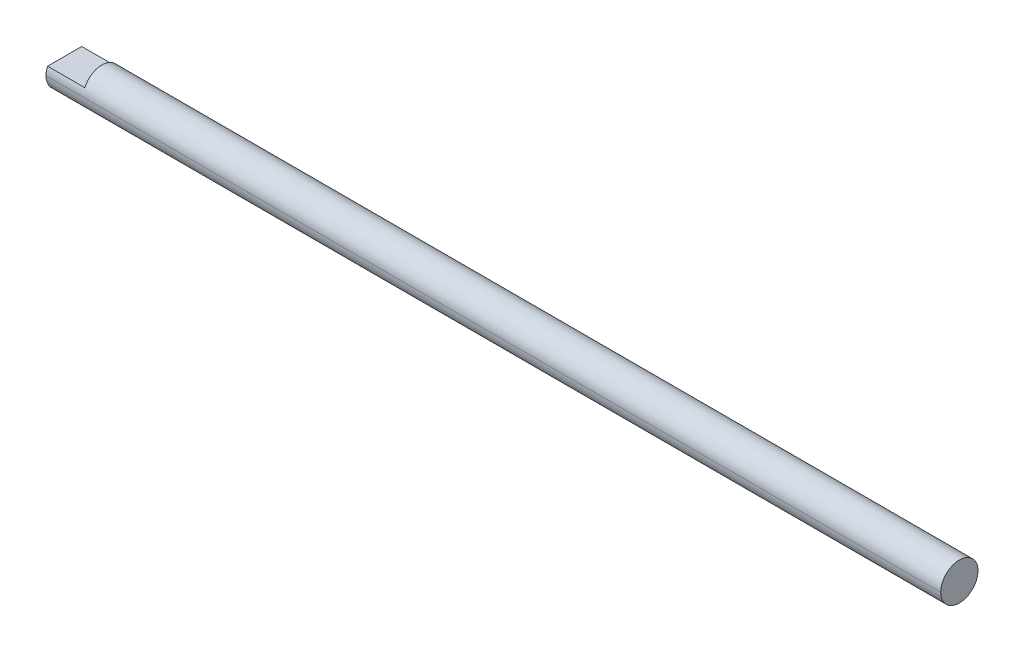
ISO-10303-21;
HEADER;
FILE_DESCRIPTION(('STEP AP214'),'2;1');
FILE_NAME('part.step','',(''),(''),'','','');
FILE_SCHEMA(('AUTOMOTIVE_DESIGN { 1 0 10303 214 1 1 1 1 }'));
ENDSEC;
DATA;
#1=APPLICATION_CONTEXT('core data for automotive mechanical design processes');
#2=APPLICATION_PROTOCOL_DEFINITION('international standard','automotive_design',2000,#1);
#3=PRODUCT_CONTEXT('',#1,'mechanical');
#4=PRODUCT('Part','Part','',(#3));
#5=PRODUCT_RELATED_PRODUCT_CATEGORY('part','',(#4));
#6=PRODUCT_DEFINITION_FORMATION('','',#4);
#7=PRODUCT_DEFINITION_CONTEXT('part definition',#1,'design');
#8=PRODUCT_DEFINITION('design','',#6,#7);
#9=PRODUCT_DEFINITION_SHAPE('','',#8);
#10=(LENGTH_UNIT() NAMED_UNIT(*) SI_UNIT(.MILLI.,.METRE.));
#11=(NAMED_UNIT(*) PLANE_ANGLE_UNIT() SI_UNIT($,.RADIAN.));
#12=(NAMED_UNIT(*) SI_UNIT($,.STERADIAN.) SOLID_ANGLE_UNIT());
#13=UNCERTAINTY_MEASURE_WITH_UNIT(LENGTH_MEASURE(1.E-05),#10,'distance_accuracy_value','');
#14=(GEOMETRIC_REPRESENTATION_CONTEXT(3) GLOBAL_UNCERTAINTY_ASSIGNED_CONTEXT((#13)) GLOBAL_UNIT_ASSIGNED_CONTEXT((#10,
#11,#12)) REPRESENTATION_CONTEXT('',''));
#15=CARTESIAN_POINT('',(0.,0.,0.));
#16=DIRECTION('',(0.,0.,1.));
#17=DIRECTION('',(1.,0.,0.));
#18=AXIS2_PLACEMENT_3D('',#15,#16,#17);
#19=CARTESIAN_POINT('',(600.,0.,0.));
#20=DIRECTION('',(1.,0.,0.));
#21=DIRECTION('',(0.,-1.,0.));
#22=AXIS2_PLACEMENT_3D('',#19,#20,#21);
#23=CYLINDRICAL_SURFACE('',#22,5.);
#24=DIRECTION('',(-1.,0.,0.));
#25=VECTOR('',#24,1.);
#26=CARTESIAN_POINT('',(10.,1.99999999999995,-4.5825756949559));
#27=LINE('',#26,#25);
#28=CARTESIAN_POINT('',(10.,1.99999999999995,-4.5825756949559));
#29=VERTEX_POINT('',#28);
#30=CARTESIAN_POINT('',(0.,1.99999999999995,-4.58257569495586));
#31=VERTEX_POINT('',#30);
#32=EDGE_CURVE('E56',#29,#31,#27,.T.);
#33=ORIENTED_EDGE('',*,*,#32,.F.);
#34=CARTESIAN_POINT('',(10.,0.,0.));
#35=DIRECTION('',(-1.,0.,0.));
#36=DIRECTION('',(0.,0.,1.));
#37=AXIS2_PLACEMENT_3D('',#34,#35,#36);
#38=CIRCLE('',#37,5.);
#39=CARTESIAN_POINT('',(10.,1.99999999999995,4.5825756949559));
#40=VERTEX_POINT('',#39);
#41=EDGE_CURVE('E83',#40,#29,#38,.T.);
#42=ORIENTED_EDGE('',*,*,#41,.F.);
#43=DIRECTION('',(-1.,0.,0.));
#44=VECTOR('',#43,1.);
#45=CARTESIAN_POINT('',(10.,1.99999999999995,4.5825756949559));
#46=LINE('',#45,#44);
#47=CARTESIAN_POINT('',(0.,1.99999999999995,4.5825756949559));
#48=VERTEX_POINT('',#47);
#49=EDGE_CURVE('E91',#40,#48,#46,.T.);
#50=ORIENTED_EDGE('',*,*,#49,.T.);
#51=CARTESIAN_POINT('',(0.,0.,0.));
#52=DIRECTION('',(1.,0.,0.));
#53=DIRECTION('',(0.,0.,-1.));
#54=AXIS2_PLACEMENT_3D('',#51,#52,#53);
#55=CIRCLE('',#54,5.);
#56=CARTESIAN_POINT('',(0.,0.,5.));
#57=VERTEX_POINT('',#56);
#58=EDGE_CURVE('E42',#48,#57,#55,.T.);
#59=ORIENTED_EDGE('',*,*,#58,.T.);
#60=DIRECTION('',(1.,0.,0.));
#61=VECTOR('',#60,1.);
#62=CARTESIAN_POINT('',(0.,0.,5.));
#63=LINE('',#62,#61);
#64=CARTESIAN_POINT('',(240.,0.,5.));
#65=VERTEX_POINT('',#64);
#66=EDGE_CURVE('E104',#57,#65,#63,.T.);
#67=ORIENTED_EDGE('',*,*,#66,.T.);
#68=CARTESIAN_POINT('',(240.,0.,0.));
#69=DIRECTION('',(1.,0.,0.));
#70=DIRECTION('',(0.,0.,-1.));
#71=AXIS2_PLACEMENT_3D('',#68,#69,#70);
#72=CIRCLE('',#71,5.);
#73=CARTESIAN_POINT('',(240.,0.,-5.));
#74=VERTEX_POINT('',#73);
#75=EDGE_CURVE('E63',#74,#65,#72,.T.);
#76=ORIENTED_EDGE('',*,*,#75,.F.);
#77=DIRECTION('',(1.,0.,0.));
#78=VECTOR('',#77,1.);
#79=CARTESIAN_POINT('',(0.,0.,-5.));
#80=LINE('',#79,#78);
#81=CARTESIAN_POINT('',(0.,0.,-5.));
#82=VERTEX_POINT('',#81);
#83=EDGE_CURVE('E101',#82,#74,#80,.T.);
#84=ORIENTED_EDGE('',*,*,#83,.F.);
#85=EDGE_CURVE('E48',#82,#31,#55,.T.);
#86=ORIENTED_EDGE('',*,*,#85,.T.);
#87=EDGE_LOOP('',(#33,#42,#50,#59,#67,#76,#84,#86));
#88=FACE_BOUND('',#87,.T.);
#89=ADVANCED_FACE('F38',(#88),#23,.T.);
#90=CARTESIAN_POINT('',(600.,0.,0.));
#91=DIRECTION('',(1.,0.,0.));
#92=DIRECTION('',(0.,1.,0.));
#93=AXIS2_PLACEMENT_3D('',#90,#91,#92);
#94=CYLINDRICAL_SURFACE('',#93,5.);
#95=ORIENTED_EDGE('',*,*,#83,.T.);
#96=EDGE_CURVE('E96',#65,#74,#72,.T.);
#97=ORIENTED_EDGE('',*,*,#96,.F.);
#98=ORIENTED_EDGE('',*,*,#66,.F.);
#99=CARTESIAN_POINT('',(0.,0.,0.));
#100=DIRECTION('',(1.,0.,0.));
#101=DIRECTION('',(0.,0.,-1.));
#102=AXIS2_PLACEMENT_3D('',#99,#100,#101);
#103=CIRCLE('',#102,5.);
#104=EDGE_CURVE('E11',#57,#82,#103,.T.);
#105=ORIENTED_EDGE('',*,*,#104,.T.);
#106=EDGE_LOOP('',(#95,#97,#98,#105));
#107=FACE_BOUND('',#106,.T.);
#108=ADVANCED_FACE('F119',(#107),#94,.T.);
#109=CARTESIAN_POINT('',(0.,0.,0.));
#110=DIRECTION('',(1.,0.,0.));
#111=DIRECTION('',(0.,0.,-1.));
#112=AXIS2_PLACEMENT_3D('',#109,#110,#111);
#113=PLANE('',#112);
#114=ORIENTED_EDGE('',*,*,#58,.F.);
#115=DIRECTION('',(0.,0.,1.));
#116=VECTOR('',#115,1.);
#117=CARTESIAN_POINT('',(0.,1.99999999999995,0.));
#118=LINE('',#117,#116);
#119=EDGE_CURVE('E88',#31,#48,#118,.T.);
#120=ORIENTED_EDGE('',*,*,#119,.F.);
#121=ORIENTED_EDGE('',*,*,#85,.F.);
#122=ORIENTED_EDGE('',*,*,#104,.F.);
#123=EDGE_LOOP('',(#114,#120,#121,#122));
#124=FACE_BOUND('',#123,.T.);
#125=ADVANCED_FACE('F40',(#124),#113,.F.);
#126=CARTESIAN_POINT('',(240.,0.,0.));
#127=DIRECTION('',(1.,0.,0.));
#128=DIRECTION('',(0.,0.,-1.));
#129=AXIS2_PLACEMENT_3D('',#126,#127,#128);
#130=PLANE('',#129);
#131=ORIENTED_EDGE('',*,*,#75,.T.);
#132=ORIENTED_EDGE('',*,*,#96,.T.);
#133=EDGE_LOOP('',(#131,#132));
#134=FACE_BOUND('',#133,.T.);
#135=ADVANCED_FACE('F120',(#134),#130,.T.);
#136=CARTESIAN_POINT('',(10.,1.99999999999995,0.));
#137=DIRECTION('',(0.,-1.,0.));
#138=DIRECTION('',(0.,0.,-1.));
#139=AXIS2_PLACEMENT_3D('',#136,#137,#138);
#140=PLANE('',#139);
#141=ORIENTED_EDGE('',*,*,#119,.T.);
#142=ORIENTED_EDGE('',*,*,#49,.F.);
#143=DIRECTION('',(0.,0.,1.));
#144=VECTOR('',#143,1.);
#145=CARTESIAN_POINT('',(10.,1.99999999999995,0.));
#146=LINE('',#145,#144);
#147=EDGE_CURVE('E85',#29,#40,#146,.T.);
#148=ORIENTED_EDGE('',*,*,#147,.F.);
#149=ORIENTED_EDGE('',*,*,#32,.T.);
#150=EDGE_LOOP('',(#141,#142,#148,#149));
#151=FACE_BOUND('',#150,.T.);
#152=ADVANCED_FACE('F90',(#151),#140,.F.);
#153=CARTESIAN_POINT('',(10.,0.,0.));
#154=DIRECTION('',(-1.,0.,0.));
#155=DIRECTION('',(0.,0.,1.));
#156=AXIS2_PLACEMENT_3D('',#153,#154,#155);
#157=PLANE('',#156);
#158=ORIENTED_EDGE('',*,*,#41,.T.);
#159=ORIENTED_EDGE('',*,*,#147,.T.);
#160=EDGE_LOOP('',(#158,#159));
#161=FACE_BOUND('',#160,.T.);
#162=ADVANCED_FACE('F84',(#161),#157,.T.);
#163=CLOSED_SHELL('',(#89,#108,#125,#135,#152,#162));
#164=MANIFOLD_SOLID_BREP('B2',#163);
#165=ADVANCED_BREP_SHAPE_REPRESENTATION('',(#18,#164),#14);
#166=SHAPE_DEFINITION_REPRESENTATION(#9,#165);
ENDSEC;
END-ISO-10303-21;
